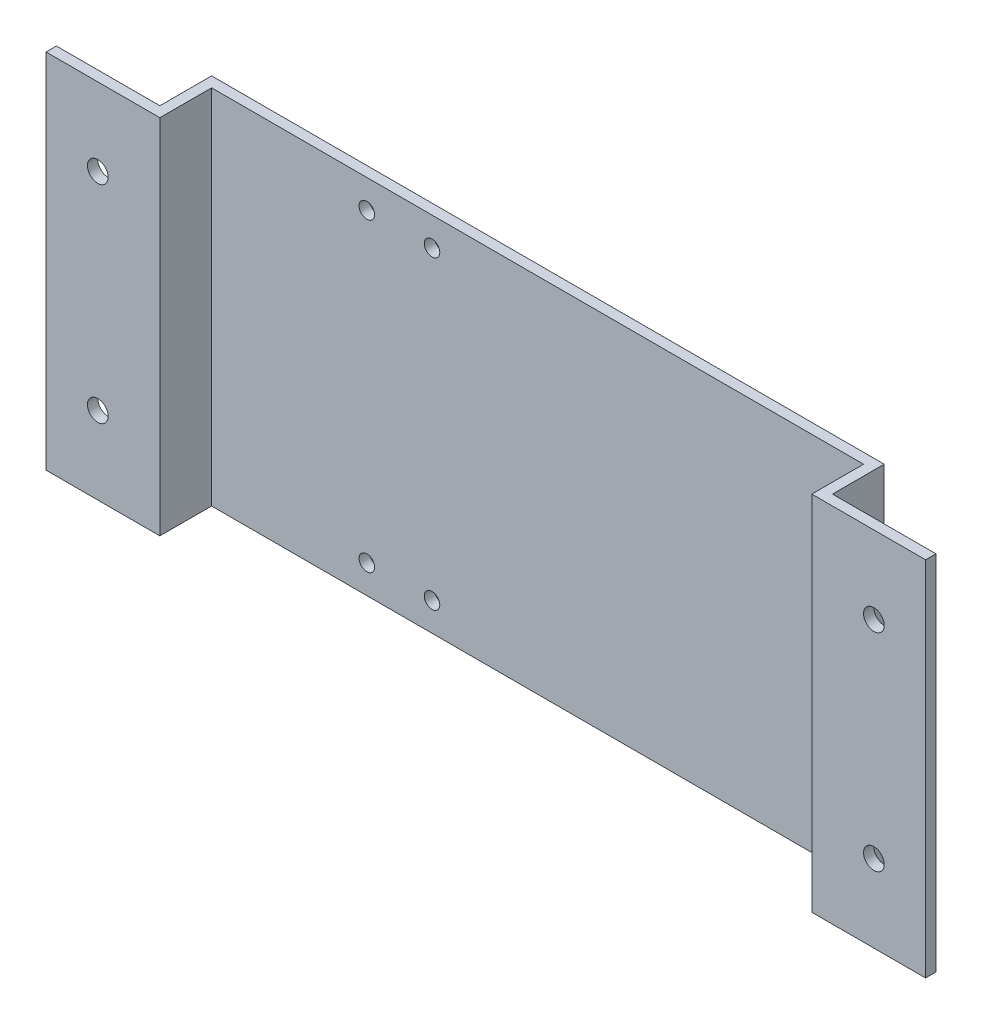
ISO-10303-21;
HEADER;
FILE_DESCRIPTION(('STEP AP214'),'2;1');
FILE_NAME('part.step','',(''),(''),'','','');
FILE_SCHEMA(('AUTOMOTIVE_DESIGN { 1 0 10303 214 1 1 1 1 }'));
ENDSEC;
DATA;
#1=APPLICATION_CONTEXT('core data for automotive mechanical design processes');
#2=APPLICATION_PROTOCOL_DEFINITION('international standard','automotive_design',2000,#1);
#3=PRODUCT_CONTEXT('',#1,'mechanical');
#4=PRODUCT('Part','Part','',(#3));
#5=PRODUCT_RELATED_PRODUCT_CATEGORY('part','',(#4));
#6=PRODUCT_DEFINITION_FORMATION('','',#4);
#7=PRODUCT_DEFINITION_CONTEXT('part definition',#1,'design');
#8=PRODUCT_DEFINITION('design','',#6,#7);
#9=PRODUCT_DEFINITION_SHAPE('','',#8);
#10=(LENGTH_UNIT() NAMED_UNIT(*) SI_UNIT(.MILLI.,.METRE.));
#11=(NAMED_UNIT(*) PLANE_ANGLE_UNIT() SI_UNIT($,.RADIAN.));
#12=(NAMED_UNIT(*) SI_UNIT($,.STERADIAN.) SOLID_ANGLE_UNIT());
#13=UNCERTAINTY_MEASURE_WITH_UNIT(LENGTH_MEASURE(1.E-05),#10,'distance_accuracy_value','');
#14=(GEOMETRIC_REPRESENTATION_CONTEXT(3) GLOBAL_UNCERTAINTY_ASSIGNED_CONTEXT((#13)) GLOBAL_UNIT_ASSIGNED_CONTEXT((#10,
#11,#12)) REPRESENTATION_CONTEXT('',''));
#15=CARTESIAN_POINT('',(0.,0.,0.));
#16=DIRECTION('',(0.,0.,1.));
#17=DIRECTION('',(1.,0.,0.));
#18=AXIS2_PLACEMENT_3D('',#15,#16,#17);
#19=CARTESIAN_POINT('',(-63.,35.,2.));
#20=DIRECTION('',(0.,-1.,0.));
#21=DIRECTION('',(0.,0.,-1.));
#22=AXIS2_PLACEMENT_3D('',#19,#20,#21);
#23=PLANE('',#22);
#24=DIRECTION('',(-1.,0.,0.));
#25=VECTOR('',#24,1.);
#26=CARTESIAN_POINT('',(-63.,35.,0.));
#27=LINE('',#26,#25);
#28=CARTESIAN_POINT('',(65.,35.,0.));
#29=VERTEX_POINT('',#28);
#30=CARTESIAN_POINT('',(-65.,35.,0.));
#31=VERTEX_POINT('',#30);
#32=EDGE_CURVE('E226',#29,#31,#27,.T.);
#33=ORIENTED_EDGE('',*,*,#32,.T.);
#34=DIRECTION('',(0.,0.,1.));
#35=VECTOR('',#34,1.);
#36=CARTESIAN_POINT('',(-65.,35.,10.));
#37=LINE('',#36,#35);
#38=CARTESIAN_POINT('',(-65.,35.,10.));
#39=VERTEX_POINT('',#38);
#40=EDGE_CURVE('E178',#31,#39,#37,.T.);
#41=ORIENTED_EDGE('',*,*,#40,.T.);
#42=DIRECTION('',(-1.,0.,0.));
#43=VECTOR('',#42,1.);
#44=CARTESIAN_POINT('',(-85.,35.,10.));
#45=LINE('',#44,#43);
#46=CARTESIAN_POINT('',(-85.,35.,10.));
#47=VERTEX_POINT('',#46);
#48=EDGE_CURVE('E181',#39,#47,#45,.T.);
#49=ORIENTED_EDGE('',*,*,#48,.T.);
#50=DIRECTION('',(0.,0.,1.));
#51=VECTOR('',#50,1.);
#52=CARTESIAN_POINT('',(-85.,35.,12.));
#53=LINE('',#52,#51);
#54=CARTESIAN_POINT('',(-85.,35.,12.));
#55=VERTEX_POINT('',#54);
#56=EDGE_CURVE('E184',#47,#55,#53,.T.);
#57=ORIENTED_EDGE('',*,*,#56,.T.);
#58=DIRECTION('',(1.,0.,0.));
#59=VECTOR('',#58,1.);
#60=CARTESIAN_POINT('',(-63.,35.,12.));
#61=LINE('',#60,#59);
#62=CARTESIAN_POINT('',(-63.,35.,12.));
#63=VERTEX_POINT('',#62);
#64=EDGE_CURVE('E187',#55,#63,#61,.T.);
#65=ORIENTED_EDGE('',*,*,#64,.T.);
#66=DIRECTION('',(0.,0.,-1.));
#67=VECTOR('',#66,1.);
#68=CARTESIAN_POINT('',(-63.,35.,0.));
#69=LINE('',#68,#67);
#70=CARTESIAN_POINT('',(-63.,35.,2.));
#71=VERTEX_POINT('',#70);
#72=EDGE_CURVE('E190',#63,#71,#69,.T.);
#73=ORIENTED_EDGE('',*,*,#72,.T.);
#74=DIRECTION('',(-1.,0.,0.));
#75=VECTOR('',#74,1.);
#76=CARTESIAN_POINT('',(-63.,35.,2.));
#77=LINE('',#76,#75);
#78=CARTESIAN_POINT('',(63.,35.,2.));
#79=VERTEX_POINT('',#78);
#80=EDGE_CURVE('E142',#79,#71,#77,.T.);
#81=ORIENTED_EDGE('',*,*,#80,.F.);
#82=DIRECTION('',(0.,0.,-1.));
#83=VECTOR('',#82,1.);
#84=CARTESIAN_POINT('',(63.,35.,0.));
#85=LINE('',#84,#83);
#86=CARTESIAN_POINT('',(63.,35.,12.));
#87=VERTEX_POINT('',#86);
#88=EDGE_CURVE('E56',#87,#79,#85,.T.);
#89=ORIENTED_EDGE('',*,*,#88,.F.);
#90=DIRECTION('',(-1.,0.,0.));
#91=VECTOR('',#90,1.);
#92=CARTESIAN_POINT('',(63.,35.,12.));
#93=LINE('',#92,#91);
#94=CARTESIAN_POINT('',(85.,35.,12.));
#95=VERTEX_POINT('',#94);
#96=EDGE_CURVE('E132',#95,#87,#93,.T.);
#97=ORIENTED_EDGE('',*,*,#96,.F.);
#98=DIRECTION('',(0.,0.,1.));
#99=VECTOR('',#98,1.);
#100=CARTESIAN_POINT('',(85.,35.,12.));
#101=LINE('',#100,#99);
#102=CARTESIAN_POINT('',(85.,35.,10.));
#103=VERTEX_POINT('',#102);
#104=EDGE_CURVE('E138',#103,#95,#101,.T.);
#105=ORIENTED_EDGE('',*,*,#104,.F.);
#106=DIRECTION('',(1.,0.,0.));
#107=VECTOR('',#106,1.);
#108=CARTESIAN_POINT('',(85.,35.,10.));
#109=LINE('',#108,#107);
#110=CARTESIAN_POINT('',(65.,35.,10.));
#111=VERTEX_POINT('',#110);
#112=EDGE_CURVE('E154',#111,#103,#109,.T.);
#113=ORIENTED_EDGE('',*,*,#112,.F.);
#114=DIRECTION('',(0.,0.,1.));
#115=VECTOR('',#114,1.);
#116=CARTESIAN_POINT('',(65.,35.,10.));
#117=LINE('',#116,#115);
#118=EDGE_CURVE('E129',#29,#111,#117,.T.);
#119=ORIENTED_EDGE('',*,*,#118,.F.);
#120=EDGE_LOOP('',(#33,#41,#49,#57,#65,#73,#81,#89,#97,#105,#113,#119));
#121=FACE_BOUND('',#120,.T.);
#122=ADVANCED_FACE('F32',(#121),#23,.F.);
#123=CARTESIAN_POINT('',(-63.,-35.,2.));
#124=DIRECTION('',(0.,1.,0.));
#125=DIRECTION('',(0.,0.,1.));
#126=AXIS2_PLACEMENT_3D('',#123,#124,#125);
#127=PLANE('',#126);
#128=DIRECTION('',(1.,0.,0.));
#129=VECTOR('',#128,1.);
#130=CARTESIAN_POINT('',(-63.,-35.,0.));
#131=LINE('',#130,#129);
#132=CARTESIAN_POINT('',(-65.,-35.,0.));
#133=VERTEX_POINT('',#132);
#134=CARTESIAN_POINT('',(65.,-35.,0.));
#135=VERTEX_POINT('',#134);
#136=EDGE_CURVE('E35',#133,#135,#131,.T.);
#137=ORIENTED_EDGE('',*,*,#136,.T.);
#138=DIRECTION('',(0.,0.,-1.));
#139=VECTOR('',#138,1.);
#140=CARTESIAN_POINT('',(65.,-35.,10.));
#141=LINE('',#140,#139);
#142=CARTESIAN_POINT('',(65.,-35.,10.));
#143=VERTEX_POINT('',#142);
#144=EDGE_CURVE('E150',#143,#135,#141,.T.);
#145=ORIENTED_EDGE('',*,*,#144,.F.);
#146=DIRECTION('',(-1.,0.,0.));
#147=VECTOR('',#146,1.);
#148=CARTESIAN_POINT('',(85.,-35.,10.));
#149=LINE('',#148,#147);
#150=CARTESIAN_POINT('',(85.,-35.,10.));
#151=VERTEX_POINT('',#150);
#152=EDGE_CURVE('E245',#151,#143,#149,.T.);
#153=ORIENTED_EDGE('',*,*,#152,.F.);
#154=DIRECTION('',(0.,0.,-1.));
#155=VECTOR('',#154,1.);
#156=CARTESIAN_POINT('',(85.,-35.,12.));
#157=LINE('',#156,#155);
#158=CARTESIAN_POINT('',(85.,-35.,12.));
#159=VERTEX_POINT('',#158);
#160=EDGE_CURVE('E246',#159,#151,#157,.T.);
#161=ORIENTED_EDGE('',*,*,#160,.F.);
#162=DIRECTION('',(1.,0.,0.));
#163=VECTOR('',#162,1.);
#164=CARTESIAN_POINT('',(63.,-35.,12.));
#165=LINE('',#164,#163);
#166=CARTESIAN_POINT('',(63.,-35.,12.));
#167=VERTEX_POINT('',#166);
#168=EDGE_CURVE('E168',#167,#159,#165,.T.);
#169=ORIENTED_EDGE('',*,*,#168,.F.);
#170=DIRECTION('',(0.,0.,1.));
#171=VECTOR('',#170,1.);
#172=CARTESIAN_POINT('',(63.,-35.,0.));
#173=LINE('',#172,#171);
#174=CARTESIAN_POINT('',(63.,-35.,2.));
#175=VERTEX_POINT('',#174);
#176=EDGE_CURVE('E124',#175,#167,#173,.T.);
#177=ORIENTED_EDGE('',*,*,#176,.F.);
#178=DIRECTION('',(1.,0.,0.));
#179=VECTOR('',#178,1.);
#180=CARTESIAN_POINT('',(-63.,-35.,2.));
#181=LINE('',#180,#179);
#182=CARTESIAN_POINT('',(-63.,-35.,2.));
#183=VERTEX_POINT('',#182);
#184=EDGE_CURVE('E11',#183,#175,#181,.T.);
#185=ORIENTED_EDGE('',*,*,#184,.F.);
#186=DIRECTION('',(0.,0.,1.));
#187=VECTOR('',#186,1.);
#188=CARTESIAN_POINT('',(-63.,-35.,0.));
#189=LINE('',#188,#187);
#190=CARTESIAN_POINT('',(-63.,-35.,12.));
#191=VERTEX_POINT('',#190);
#192=EDGE_CURVE('E48',#183,#191,#189,.T.);
#193=ORIENTED_EDGE('',*,*,#192,.T.);
#194=DIRECTION('',(-1.,0.,0.));
#195=VECTOR('',#194,1.);
#196=CARTESIAN_POINT('',(-63.,-35.,12.));
#197=LINE('',#196,#195);
#198=CARTESIAN_POINT('',(-85.,-35.,12.));
#199=VERTEX_POINT('',#198);
#200=EDGE_CURVE('E174',#191,#199,#197,.T.);
#201=ORIENTED_EDGE('',*,*,#200,.T.);
#202=DIRECTION('',(0.,0.,-1.));
#203=VECTOR('',#202,1.);
#204=CARTESIAN_POINT('',(-85.,-35.,12.));
#205=LINE('',#204,#203);
#206=CARTESIAN_POINT('',(-85.,-35.,10.));
#207=VERTEX_POINT('',#206);
#208=EDGE_CURVE('E171',#199,#207,#205,.T.);
#209=ORIENTED_EDGE('',*,*,#208,.T.);
#210=DIRECTION('',(1.,0.,0.));
#211=VECTOR('',#210,1.);
#212=CARTESIAN_POINT('',(-85.,-35.,10.));
#213=LINE('',#212,#211);
#214=CARTESIAN_POINT('',(-65.,-35.,10.));
#215=VERTEX_POINT('',#214);
#216=EDGE_CURVE('E169',#207,#215,#213,.T.);
#217=ORIENTED_EDGE('',*,*,#216,.T.);
#218=DIRECTION('',(0.,0.,-1.));
#219=VECTOR('',#218,1.);
#220=CARTESIAN_POINT('',(-65.,-35.,10.));
#221=LINE('',#220,#219);
#222=EDGE_CURVE('E177',#215,#133,#221,.T.);
#223=ORIENTED_EDGE('',*,*,#222,.T.);
#224=EDGE_LOOP('',(#137,#145,#153,#161,#169,#177,#185,#193,#201,#209,#217,#223));
#225=FACE_BOUND('',#224,.T.);
#226=ADVANCED_FACE('F235',(#225),#127,.F.);
#227=CARTESIAN_POINT('',(0.,0.,2.));
#228=DIRECTION('',(0.,0.,-1.));
#229=DIRECTION('',(-1.,0.,0.));
#230=AXIS2_PLACEMENT_3D('',#227,#228,#229);
#231=PLANE('',#230);
#232=CARTESIAN_POINT('',(-33.,29.5,2.));
#233=DIRECTION('',(0.,0.,1.));
#234=DIRECTION('',(1.,0.,0.));
#235=AXIS2_PLACEMENT_3D('',#232,#233,#234);
#236=CIRCLE('',#235,1.5);
#237=CARTESIAN_POINT('',(-31.5,29.5,2.));
#238=VERTEX_POINT('',#237);
#239=EDGE_CURVE('E211',#238,#238,#236,.T.);
#240=ORIENTED_EDGE('',*,*,#239,.F.);
#241=EDGE_LOOP('',(#240));
#242=FACE_BOUND('',#241,.T.);
#243=CARTESIAN_POINT('',(-20.4,-29.5,2.));
#244=DIRECTION('',(0.,0.,1.));
#245=DIRECTION('',(1.,0.,0.));
#246=AXIS2_PLACEMENT_3D('',#243,#244,#245);
#247=CIRCLE('',#246,1.5);
#248=CARTESIAN_POINT('',(-18.9,-29.5,2.));
#249=VERTEX_POINT('',#248);
#250=EDGE_CURVE('E218',#249,#249,#247,.T.);
#251=ORIENTED_EDGE('',*,*,#250,.F.);
#252=EDGE_LOOP('',(#251));
#253=FACE_BOUND('',#252,.T.);
#254=CARTESIAN_POINT('',(-33.,-29.5,2.));
#255=DIRECTION('',(0.,0.,1.));
#256=DIRECTION('',(1.,0.,0.));
#257=AXIS2_PLACEMENT_3D('',#254,#255,#256);
#258=CIRCLE('',#257,1.5);
#259=CARTESIAN_POINT('',(-31.5,-29.5,2.));
#260=VERTEX_POINT('',#259);
#261=EDGE_CURVE('E205',#260,#260,#258,.T.);
#262=ORIENTED_EDGE('',*,*,#261,.F.);
#263=EDGE_LOOP('',(#262));
#264=FACE_BOUND('',#263,.T.);
#265=CARTESIAN_POINT('',(-20.4,29.5,2.));
#266=DIRECTION('',(0.,0.,1.));
#267=DIRECTION('',(1.,0.,0.));
#268=AXIS2_PLACEMENT_3D('',#265,#266,#267);
#269=CIRCLE('',#268,1.5);
#270=CARTESIAN_POINT('',(-18.9,29.5,2.));
#271=VERTEX_POINT('',#270);
#272=EDGE_CURVE('E223',#271,#271,#269,.T.);
#273=ORIENTED_EDGE('',*,*,#272,.F.);
#274=EDGE_LOOP('',(#273));
#275=FACE_BOUND('',#274,.T.);
#276=DIRECTION('',(0.,1.,0.));
#277=VECTOR('',#276,1.);
#278=CARTESIAN_POINT('',(63.,-35.,2.));
#279=LINE('',#278,#277);
#280=EDGE_CURVE('E229',#175,#79,#279,.T.);
#281=ORIENTED_EDGE('',*,*,#280,.T.);
#282=ORIENTED_EDGE('',*,*,#80,.T.);
#283=DIRECTION('',(0.,-1.,0.));
#284=VECTOR('',#283,1.);
#285=CARTESIAN_POINT('',(-63.,-35.,2.));
#286=LINE('',#285,#284);
#287=EDGE_CURVE('E40',#71,#183,#286,.T.);
#288=ORIENTED_EDGE('',*,*,#287,.T.);
#289=ORIENTED_EDGE('',*,*,#184,.T.);
#290=EDGE_LOOP('',(#281,#282,#288,#289));
#291=FACE_BOUND('',#290,.T.);
#292=ADVANCED_FACE('F305',(#242,#253,#264,#275,#291),#231,.F.);
#293=CARTESIAN_POINT('',(0.,0.,0.));
#294=DIRECTION('',(0.,0.,-1.));
#295=DIRECTION('',(-1.,0.,0.));
#296=AXIS2_PLACEMENT_3D('',#293,#294,#295);
#297=PLANE('',#296);
#298=CARTESIAN_POINT('',(-33.,29.5,0.));
#299=DIRECTION('',(0.,0.,-1.));
#300=DIRECTION('',(-1.,0.,0.));
#301=AXIS2_PLACEMENT_3D('',#298,#299,#300);
#302=CIRCLE('',#301,1.5);
#303=CARTESIAN_POINT('',(-34.5,29.5,0.));
#304=VERTEX_POINT('',#303);
#305=EDGE_CURVE('E215',#304,#304,#302,.F.);
#306=ORIENTED_EDGE('',*,*,#305,.T.);
#307=EDGE_LOOP('',(#306));
#308=FACE_BOUND('',#307,.T.);
#309=CARTESIAN_POINT('',(-20.4,-29.5,0.));
#310=DIRECTION('',(0.,0.,-1.));
#311=DIRECTION('',(-1.,0.,0.));
#312=AXIS2_PLACEMENT_3D('',#309,#310,#311);
#313=CIRCLE('',#312,1.5);
#314=CARTESIAN_POINT('',(-21.9,-29.5,0.));
#315=VERTEX_POINT('',#314);
#316=EDGE_CURVE('E208',#315,#315,#313,.F.);
#317=ORIENTED_EDGE('',*,*,#316,.T.);
#318=EDGE_LOOP('',(#317));
#319=FACE_BOUND('',#318,.T.);
#320=CARTESIAN_POINT('',(-33.,-29.5,0.));
#321=DIRECTION('',(0.,0.,-1.));
#322=DIRECTION('',(-1.,0.,0.));
#323=AXIS2_PLACEMENT_3D('',#320,#321,#322);
#324=CIRCLE('',#323,1.5);
#325=CARTESIAN_POINT('',(-34.5,-29.5,0.));
#326=VERTEX_POINT('',#325);
#327=EDGE_CURVE('E204',#326,#326,#324,.F.);
#328=ORIENTED_EDGE('',*,*,#327,.T.);
#329=EDGE_LOOP('',(#328));
#330=FACE_BOUND('',#329,.T.);
#331=CARTESIAN_POINT('',(-20.4,29.5,0.));
#332=DIRECTION('',(0.,0.,-1.));
#333=DIRECTION('',(-1.,0.,0.));
#334=AXIS2_PLACEMENT_3D('',#331,#332,#333);
#335=CIRCLE('',#334,1.5);
#336=CARTESIAN_POINT('',(-21.9,29.5,0.));
#337=VERTEX_POINT('',#336);
#338=EDGE_CURVE('E214',#337,#337,#335,.F.);
#339=ORIENTED_EDGE('',*,*,#338,.T.);
#340=EDGE_LOOP('',(#339));
#341=FACE_BOUND('',#340,.T.);
#342=ORIENTED_EDGE('',*,*,#32,.F.);
#343=DIRECTION('',(0.,1.,0.));
#344=VECTOR('',#343,1.);
#345=CARTESIAN_POINT('',(65.,-60.0599281722833,0.));
#346=LINE('',#345,#344);
#347=EDGE_CURVE('E159',#135,#29,#346,.T.);
#348=ORIENTED_EDGE('',*,*,#347,.F.);
#349=ORIENTED_EDGE('',*,*,#136,.F.);
#350=DIRECTION('',(0.,1.,0.));
#351=VECTOR('',#350,1.);
#352=CARTESIAN_POINT('',(-65.,-60.0599281722833,0.));
#353=LINE('',#352,#351);
#354=EDGE_CURVE('E192',#133,#31,#353,.T.);
#355=ORIENTED_EDGE('',*,*,#354,.T.);
#356=EDGE_LOOP('',(#342,#348,#349,#355));
#357=FACE_BOUND('',#356,.T.);
#358=ADVANCED_FACE('F241',(#308,#319,#330,#341,#357),#297,.T.);
#359=CARTESIAN_POINT('',(-20.4,29.5,-0.00100000000000013));
#360=DIRECTION('',(0.,0.,1.));
#361=DIRECTION('',(1.,0.,0.));
#362=AXIS2_PLACEMENT_3D('',#359,#360,#361);
#363=CYLINDRICAL_SURFACE('',#362,1.5);
#364=ORIENTED_EDGE('',*,*,#338,.F.);
#365=EDGE_LOOP('',(#364));
#366=FACE_BOUND('',#365,.T.);
#367=ORIENTED_EDGE('',*,*,#272,.T.);
#368=EDGE_LOOP('',(#367));
#369=FACE_BOUND('',#368,.T.);
#370=ADVANCED_FACE('F313',(#366,#369),#363,.F.);
#371=CARTESIAN_POINT('',(-33.,-29.5,-0.00100000000000013));
#372=DIRECTION('',(0.,0.,1.));
#373=DIRECTION('',(1.,0.,0.));
#374=AXIS2_PLACEMENT_3D('',#371,#372,#373);
#375=CYLINDRICAL_SURFACE('',#374,1.5);
#376=ORIENTED_EDGE('',*,*,#327,.F.);
#377=EDGE_LOOP('',(#376));
#378=FACE_BOUND('',#377,.T.);
#379=ORIENTED_EDGE('',*,*,#261,.T.);
#380=EDGE_LOOP('',(#379));
#381=FACE_BOUND('',#380,.T.);
#382=ADVANCED_FACE('F318',(#378,#381),#375,.F.);
#383=CARTESIAN_POINT('',(-20.4,-29.5,-0.00100000000000013));
#384=DIRECTION('',(0.,0.,1.));
#385=DIRECTION('',(1.,0.,0.));
#386=AXIS2_PLACEMENT_3D('',#383,#384,#385);
#387=CYLINDRICAL_SURFACE('',#386,1.5);
#388=ORIENTED_EDGE('',*,*,#316,.F.);
#389=EDGE_LOOP('',(#388));
#390=FACE_BOUND('',#389,.T.);
#391=ORIENTED_EDGE('',*,*,#250,.T.);
#392=EDGE_LOOP('',(#391));
#393=FACE_BOUND('',#392,.T.);
#394=ADVANCED_FACE('F320',(#390,#393),#387,.F.);
#395=CARTESIAN_POINT('',(-33.,29.5,-0.00100000000000013));
#396=DIRECTION('',(0.,0.,1.));
#397=DIRECTION('',(1.,0.,0.));
#398=AXIS2_PLACEMENT_3D('',#395,#396,#397);
#399=CYLINDRICAL_SURFACE('',#398,1.5);
#400=ORIENTED_EDGE('',*,*,#305,.F.);
#401=EDGE_LOOP('',(#400));
#402=FACE_BOUND('',#401,.T.);
#403=ORIENTED_EDGE('',*,*,#239,.T.);
#404=EDGE_LOOP('',(#403));
#405=FACE_BOUND('',#404,.T.);
#406=ADVANCED_FACE('F323',(#402,#405),#399,.F.);
#407=CARTESIAN_POINT('',(-63.,-60.0599281722833,0.));
#408=DIRECTION('',(1.,0.,0.));
#409=DIRECTION('',(0.,0.,-1.));
#410=AXIS2_PLACEMENT_3D('',#407,#408,#409);
#411=PLANE('',#410);
#412=ORIENTED_EDGE('',*,*,#287,.F.);
#413=ORIENTED_EDGE('',*,*,#72,.F.);
#414=DIRECTION('',(0.,1.,0.));
#415=VECTOR('',#414,1.);
#416=CARTESIAN_POINT('',(-63.,-60.0599281722833,12.));
#417=LINE('',#416,#415);
#418=EDGE_CURVE('E172',#191,#63,#417,.T.);
#419=ORIENTED_EDGE('',*,*,#418,.F.);
#420=ORIENTED_EDGE('',*,*,#192,.F.);
#421=EDGE_LOOP('',(#412,#413,#419,#420));
#422=FACE_BOUND('',#421,.T.);
#423=ADVANCED_FACE('F326',(#422),#411,.T.);
#424=CARTESIAN_POINT('',(-63.,-60.0599281722833,12.));
#425=DIRECTION('',(0.,0.,1.));
#426=DIRECTION('',(1.,0.,0.));
#427=AXIS2_PLACEMENT_3D('',#424,#425,#426);
#428=PLANE('',#427);
#429=CARTESIAN_POINT('',(-75.,20.,12.));
#430=DIRECTION('',(0.,0.,1.));
#431=DIRECTION('',(1.,0.,0.));
#432=AXIS2_PLACEMENT_3D('',#429,#430,#431);
#433=CIRCLE('',#432,2.);
#434=CARTESIAN_POINT('',(-73.,20.,12.));
#435=VERTEX_POINT('',#434);
#436=EDGE_CURVE('E256',#435,#435,#433,.F.);
#437=ORIENTED_EDGE('',*,*,#436,.T.);
#438=EDGE_LOOP('',(#437));
#439=FACE_BOUND('',#438,.T.);
#440=CARTESIAN_POINT('',(-75.,-20.,12.));
#441=DIRECTION('',(0.,0.,1.));
#442=DIRECTION('',(1.,0.,0.));
#443=AXIS2_PLACEMENT_3D('',#440,#441,#442);
#444=CIRCLE('',#443,2.);
#445=CARTESIAN_POINT('',(-73.,-20.,12.));
#446=VERTEX_POINT('',#445);
#447=EDGE_CURVE('E268',#446,#446,#444,.F.);
#448=ORIENTED_EDGE('',*,*,#447,.T.);
#449=EDGE_LOOP('',(#448));
#450=FACE_BOUND('',#449,.T.);
#451=ORIENTED_EDGE('',*,*,#200,.F.);
#452=ORIENTED_EDGE('',*,*,#418,.T.);
#453=ORIENTED_EDGE('',*,*,#64,.F.);
#454=DIRECTION('',(0.,1.,0.));
#455=VECTOR('',#454,1.);
#456=CARTESIAN_POINT('',(-85.,-60.0599281722833,12.));
#457=LINE('',#456,#455);
#458=EDGE_CURVE('E194',#199,#55,#457,.T.);
#459=ORIENTED_EDGE('',*,*,#458,.F.);
#460=EDGE_LOOP('',(#451,#452,#453,#459));
#461=FACE_BOUND('',#460,.T.);
#462=ADVANCED_FACE('F363',(#439,#450,#461),#428,.T.);
#463=CARTESIAN_POINT('',(-85.,-60.0599281722833,12.));
#464=DIRECTION('',(-1.,0.,0.));
#465=DIRECTION('',(0.,0.,1.));
#466=AXIS2_PLACEMENT_3D('',#463,#464,#465);
#467=PLANE('',#466);
#468=ORIENTED_EDGE('',*,*,#208,.F.);
#469=ORIENTED_EDGE('',*,*,#458,.T.);
#470=ORIENTED_EDGE('',*,*,#56,.F.);
#471=DIRECTION('',(0.,1.,0.));
#472=VECTOR('',#471,1.);
#473=CARTESIAN_POINT('',(-85.,-60.0599281722833,10.));
#474=LINE('',#473,#472);
#475=EDGE_CURVE('E196',#207,#47,#474,.T.);
#476=ORIENTED_EDGE('',*,*,#475,.F.);
#477=EDGE_LOOP('',(#468,#469,#470,#476));
#478=FACE_BOUND('',#477,.T.);
#479=ADVANCED_FACE('F280',(#478),#467,.T.);
#480=CARTESIAN_POINT('',(-85.,-60.0599281722833,10.));
#481=DIRECTION('',(0.,0.,-1.));
#482=DIRECTION('',(-1.,0.,0.));
#483=AXIS2_PLACEMENT_3D('',#480,#481,#482);
#484=PLANE('',#483);
#485=CARTESIAN_POINT('',(-75.,20.,10.));
#486=DIRECTION('',(0.,0.,-1.));
#487=DIRECTION('',(-1.,0.,0.));
#488=AXIS2_PLACEMENT_3D('',#485,#486,#487);
#489=CIRCLE('',#488,2.);
#490=CARTESIAN_POINT('',(-77.,20.,10.));
#491=VERTEX_POINT('',#490);
#492=EDGE_CURVE('E259',#491,#491,#489,.T.);
#493=ORIENTED_EDGE('',*,*,#492,.F.);
#494=EDGE_LOOP('',(#493));
#495=FACE_BOUND('',#494,.T.);
#496=CARTESIAN_POINT('',(-75.,-20.,10.));
#497=DIRECTION('',(0.,0.,-1.));
#498=DIRECTION('',(-1.,0.,0.));
#499=AXIS2_PLACEMENT_3D('',#496,#497,#498);
#500=CIRCLE('',#499,2.);
#501=CARTESIAN_POINT('',(-77.,-20.,10.));
#502=VERTEX_POINT('',#501);
#503=EDGE_CURVE('E260',#502,#502,#500,.T.);
#504=ORIENTED_EDGE('',*,*,#503,.F.);
#505=EDGE_LOOP('',(#504));
#506=FACE_BOUND('',#505,.T.);
#507=ORIENTED_EDGE('',*,*,#216,.F.);
#508=ORIENTED_EDGE('',*,*,#475,.T.);
#509=ORIENTED_EDGE('',*,*,#48,.F.);
#510=DIRECTION('',(0.,1.,0.));
#511=VECTOR('',#510,1.);
#512=CARTESIAN_POINT('',(-65.,-60.0599281722833,10.));
#513=LINE('',#512,#511);
#514=EDGE_CURVE('E198',#215,#39,#513,.T.);
#515=ORIENTED_EDGE('',*,*,#514,.F.);
#516=EDGE_LOOP('',(#507,#508,#509,#515));
#517=FACE_BOUND('',#516,.T.);
#518=ADVANCED_FACE('F276',(#495,#506,#517),#484,.T.);
#519=CARTESIAN_POINT('',(-65.,-60.0599281722833,10.));
#520=DIRECTION('',(-1.,0.,0.));
#521=DIRECTION('',(0.,0.,1.));
#522=AXIS2_PLACEMENT_3D('',#519,#520,#521);
#523=PLANE('',#522);
#524=ORIENTED_EDGE('',*,*,#222,.F.);
#525=ORIENTED_EDGE('',*,*,#514,.T.);
#526=ORIENTED_EDGE('',*,*,#40,.F.);
#527=ORIENTED_EDGE('',*,*,#354,.F.);
#528=EDGE_LOOP('',(#524,#525,#526,#527));
#529=FACE_BOUND('',#528,.T.);
#530=ADVANCED_FACE('F279',(#529),#523,.T.);
#531=CARTESIAN_POINT('',(63.,-60.0599281722833,0.));
#532=DIRECTION('',(1.,0.,0.));
#533=DIRECTION('',(0.,0.,-1.));
#534=AXIS2_PLACEMENT_3D('',#531,#532,#533);
#535=PLANE('',#534);
#536=ORIENTED_EDGE('',*,*,#280,.F.);
#537=ORIENTED_EDGE('',*,*,#176,.T.);
#538=DIRECTION('',(0.,1.,0.));
#539=VECTOR('',#538,1.);
#540=CARTESIAN_POINT('',(63.,-60.0599281722833,12.));
#541=LINE('',#540,#539);
#542=EDGE_CURVE('E120',#167,#87,#541,.T.);
#543=ORIENTED_EDGE('',*,*,#542,.T.);
#544=ORIENTED_EDGE('',*,*,#88,.T.);
#545=EDGE_LOOP('',(#536,#537,#543,#544));
#546=FACE_BOUND('',#545,.T.);
#547=ADVANCED_FACE('F122',(#546),#535,.F.);
#548=CARTESIAN_POINT('',(63.,-60.0599281722833,12.));
#549=DIRECTION('',(0.,0.,-1.));
#550=DIRECTION('',(-1.,0.,0.));
#551=AXIS2_PLACEMENT_3D('',#548,#549,#550);
#552=PLANE('',#551);
#553=CARTESIAN_POINT('',(75.,-20.,12.));
#554=DIRECTION('',(0.,0.,-1.));
#555=DIRECTION('',(-1.,0.,0.));
#556=AXIS2_PLACEMENT_3D('',#553,#554,#555);
#557=CIRCLE('',#556,2.);
#558=CARTESIAN_POINT('',(73.,-20.,12.));
#559=VERTEX_POINT('',#558);
#560=EDGE_CURVE('E255',#559,#559,#557,.F.);
#561=ORIENTED_EDGE('',*,*,#560,.F.);
#562=EDGE_LOOP('',(#561));
#563=FACE_BOUND('',#562,.T.);
#564=CARTESIAN_POINT('',(75.,20.,12.));
#565=DIRECTION('',(0.,0.,-1.));
#566=DIRECTION('',(-1.,0.,0.));
#567=AXIS2_PLACEMENT_3D('',#564,#565,#566);
#568=CIRCLE('',#567,2.);
#569=CARTESIAN_POINT('',(73.,20.,12.));
#570=VERTEX_POINT('',#569);
#571=EDGE_CURVE('E144',#570,#570,#568,.F.);
#572=ORIENTED_EDGE('',*,*,#571,.F.);
#573=EDGE_LOOP('',(#572));
#574=FACE_BOUND('',#573,.T.);
#575=ORIENTED_EDGE('',*,*,#542,.F.);
#576=ORIENTED_EDGE('',*,*,#168,.T.);
#577=DIRECTION('',(0.,1.,0.));
#578=VECTOR('',#577,1.);
#579=CARTESIAN_POINT('',(85.,-60.0599281722833,12.));
#580=LINE('',#579,#578);
#581=EDGE_CURVE('E128',#159,#95,#580,.T.);
#582=ORIENTED_EDGE('',*,*,#581,.T.);
#583=ORIENTED_EDGE('',*,*,#96,.T.);
#584=EDGE_LOOP('',(#575,#576,#582,#583));
#585=FACE_BOUND('',#584,.T.);
#586=ADVANCED_FACE('F133',(#563,#574,#585),#552,.F.);
#587=CARTESIAN_POINT('',(85.,-60.0599281722833,12.));
#588=DIRECTION('',(-1.,0.,0.));
#589=DIRECTION('',(0.,0.,1.));
#590=AXIS2_PLACEMENT_3D('',#587,#588,#589);
#591=PLANE('',#590);
#592=ORIENTED_EDGE('',*,*,#581,.F.);
#593=ORIENTED_EDGE('',*,*,#160,.T.);
#594=DIRECTION('',(0.,1.,0.));
#595=VECTOR('',#594,1.);
#596=CARTESIAN_POINT('',(85.,-60.0599281722833,10.));
#597=LINE('',#596,#595);
#598=EDGE_CURVE('E164',#151,#103,#597,.T.);
#599=ORIENTED_EDGE('',*,*,#598,.T.);
#600=ORIENTED_EDGE('',*,*,#104,.T.);
#601=EDGE_LOOP('',(#592,#593,#599,#600));
#602=FACE_BOUND('',#601,.T.);
#603=ADVANCED_FACE('F341',(#602),#591,.F.);
#604=CARTESIAN_POINT('',(85.,-60.0599281722833,10.));
#605=DIRECTION('',(0.,0.,1.));
#606=DIRECTION('',(1.,0.,0.));
#607=AXIS2_PLACEMENT_3D('',#604,#605,#606);
#608=PLANE('',#607);
#609=CARTESIAN_POINT('',(75.,-20.,9.99999999999998));
#610=DIRECTION('',(0.,0.,-1.));
#611=DIRECTION('',(-1.,0.,0.));
#612=AXIS2_PLACEMENT_3D('',#609,#610,#611);
#613=CIRCLE('',#612,2.);
#614=CARTESIAN_POINT('',(73.,-20.,9.99999999999998));
#615=VERTEX_POINT('',#614);
#616=EDGE_CURVE('E263',#615,#615,#613,.T.);
#617=ORIENTED_EDGE('',*,*,#616,.F.);
#618=EDGE_LOOP('',(#617));
#619=FACE_BOUND('',#618,.T.);
#620=CARTESIAN_POINT('',(75.,20.,9.99999999999998));
#621=DIRECTION('',(0.,0.,-1.));
#622=DIRECTION('',(-1.,0.,0.));
#623=AXIS2_PLACEMENT_3D('',#620,#621,#622);
#624=CIRCLE('',#623,2.);
#625=CARTESIAN_POINT('',(73.,20.,9.99999999999998));
#626=VERTEX_POINT('',#625);
#627=EDGE_CURVE('E147',#626,#626,#624,.T.);
#628=ORIENTED_EDGE('',*,*,#627,.F.);
#629=EDGE_LOOP('',(#628));
#630=FACE_BOUND('',#629,.T.);
#631=ORIENTED_EDGE('',*,*,#598,.F.);
#632=ORIENTED_EDGE('',*,*,#152,.T.);
#633=DIRECTION('',(0.,1.,0.));
#634=VECTOR('',#633,1.);
#635=CARTESIAN_POINT('',(65.,-60.0599281722833,10.));
#636=LINE('',#635,#634);
#637=EDGE_CURVE('E162',#143,#111,#636,.T.);
#638=ORIENTED_EDGE('',*,*,#637,.T.);
#639=ORIENTED_EDGE('',*,*,#112,.T.);
#640=EDGE_LOOP('',(#631,#632,#638,#639));
#641=FACE_BOUND('',#640,.T.);
#642=ADVANCED_FACE('F343',(#619,#630,#641),#608,.F.);
#643=CARTESIAN_POINT('',(65.,-60.0599281722833,10.));
#644=DIRECTION('',(-1.,0.,0.));
#645=DIRECTION('',(0.,0.,1.));
#646=AXIS2_PLACEMENT_3D('',#643,#644,#645);
#647=PLANE('',#646);
#648=ORIENTED_EDGE('',*,*,#637,.F.);
#649=ORIENTED_EDGE('',*,*,#144,.T.);
#650=ORIENTED_EDGE('',*,*,#347,.T.);
#651=ORIENTED_EDGE('',*,*,#118,.T.);
#652=EDGE_LOOP('',(#648,#649,#650,#651));
#653=FACE_BOUND('',#652,.T.);
#654=ADVANCED_FACE('F243',(#653),#647,.F.);
#655=CARTESIAN_POINT('',(75.,20.,12.001));
#656=DIRECTION('',(0.,0.,-1.));
#657=DIRECTION('',(-1.,0.,0.));
#658=AXIS2_PLACEMENT_3D('',#655,#656,#657);
#659=CYLINDRICAL_SURFACE('',#658,2.);
#660=ORIENTED_EDGE('',*,*,#627,.T.);
#661=EDGE_LOOP('',(#660));
#662=FACE_BOUND('',#661,.T.);
#663=ORIENTED_EDGE('',*,*,#571,.T.);
#664=EDGE_LOOP('',(#663));
#665=FACE_BOUND('',#664,.T.);
#666=ADVANCED_FACE('F351',(#662,#665),#659,.F.);
#667=CARTESIAN_POINT('',(75.,-20.,12.001));
#668=DIRECTION('',(0.,0.,-1.));
#669=DIRECTION('',(-1.,0.,0.));
#670=AXIS2_PLACEMENT_3D('',#667,#668,#669);
#671=CYLINDRICAL_SURFACE('',#670,2.);
#672=ORIENTED_EDGE('',*,*,#616,.T.);
#673=EDGE_LOOP('',(#672));
#674=FACE_BOUND('',#673,.T.);
#675=ORIENTED_EDGE('',*,*,#560,.T.);
#676=EDGE_LOOP('',(#675));
#677=FACE_BOUND('',#676,.T.);
#678=ADVANCED_FACE('F403',(#674,#677),#671,.F.);
#679=CARTESIAN_POINT('',(-75.,-20.,12.001));
#680=DIRECTION('',(0.,0.,-1.));
#681=DIRECTION('',(-1.,0.,0.));
#682=AXIS2_PLACEMENT_3D('',#679,#680,#681);
#683=CYLINDRICAL_SURFACE('',#682,2.);
#684=ORIENTED_EDGE('',*,*,#447,.F.);
#685=EDGE_LOOP('',(#684));
#686=FACE_BOUND('',#685,.T.);
#687=ORIENTED_EDGE('',*,*,#503,.T.);
#688=EDGE_LOOP('',(#687));
#689=FACE_BOUND('',#688,.T.);
#690=ADVANCED_FACE('F274',(#686,#689),#683,.F.);
#691=CARTESIAN_POINT('',(-75.,20.,12.001));
#692=DIRECTION('',(0.,0.,-1.));
#693=DIRECTION('',(-1.,0.,0.));
#694=AXIS2_PLACEMENT_3D('',#691,#692,#693);
#695=CYLINDRICAL_SURFACE('',#694,2.);
#696=ORIENTED_EDGE('',*,*,#436,.F.);
#697=EDGE_LOOP('',(#696));
#698=FACE_BOUND('',#697,.T.);
#699=ORIENTED_EDGE('',*,*,#492,.T.);
#700=EDGE_LOOP('',(#699));
#701=FACE_BOUND('',#700,.T.);
#702=ADVANCED_FACE('F421',(#698,#701),#695,.F.);
#703=CLOSED_SHELL('',(#122,#226,#292,#358,#370,#382,#394,#406,#423,#462,#479,#518,#530,#547,
#586,#603,#642,#654,#666,#678,#690,#702));
#704=MANIFOLD_SOLID_BREP('B2',#703);
#705=ADVANCED_BREP_SHAPE_REPRESENTATION('',(#18,#704),#14);
#706=SHAPE_DEFINITION_REPRESENTATION(#9,#705);
ENDSEC;
END-ISO-10303-21;
